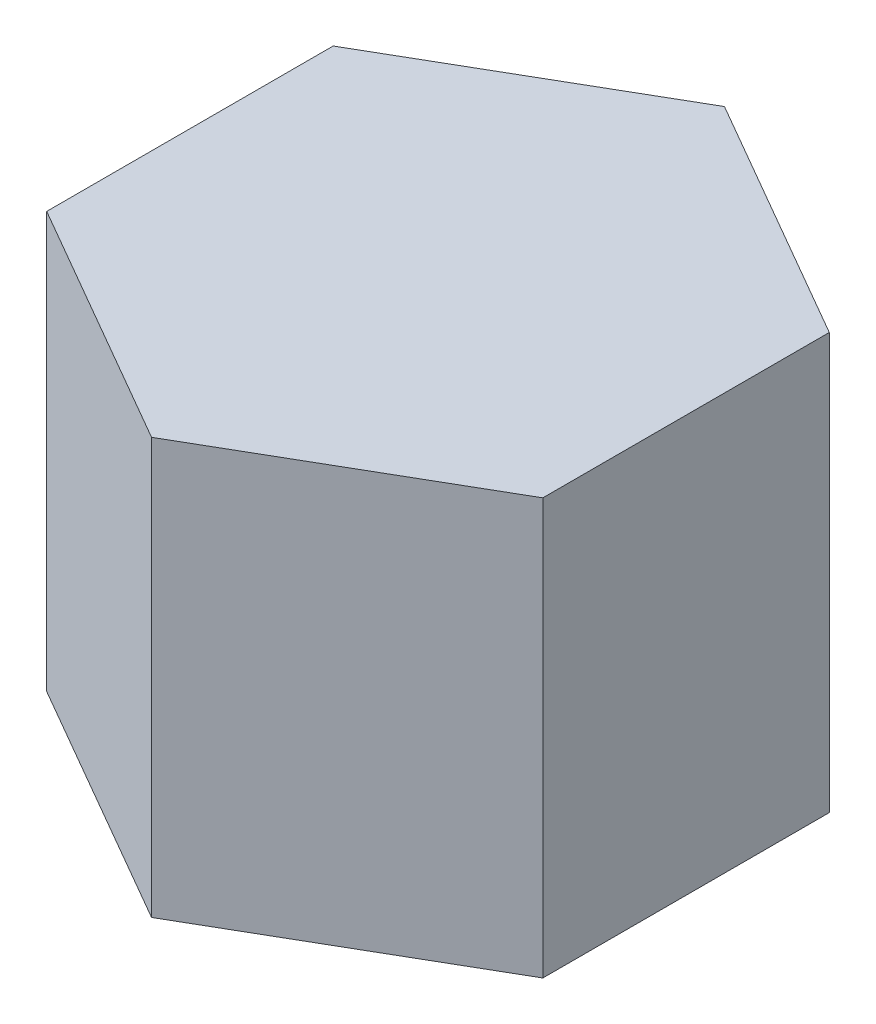
ISO-10303-21;
HEADER;
FILE_DESCRIPTION(('STEP AP214'),'2;1');
FILE_NAME('part.step','',(''),(''),'','','');
FILE_SCHEMA(('AUTOMOTIVE_DESIGN { 1 0 10303 214 1 1 1 1 }'));
ENDSEC;
DATA;
#1=APPLICATION_CONTEXT('core data for automotive mechanical design processes');
#2=APPLICATION_PROTOCOL_DEFINITION('international standard','automotive_design',2000,#1);
#3=PRODUCT_CONTEXT('',#1,'mechanical');
#4=PRODUCT('Part','Part','',(#3));
#5=PRODUCT_RELATED_PRODUCT_CATEGORY('part','',(#4));
#6=PRODUCT_DEFINITION_FORMATION('','',#4);
#7=PRODUCT_DEFINITION_CONTEXT('part definition',#1,'design');
#8=PRODUCT_DEFINITION('design','',#6,#7);
#9=PRODUCT_DEFINITION_SHAPE('','',#8);
#10=(LENGTH_UNIT() NAMED_UNIT(*) SI_UNIT(.MILLI.,.METRE.));
#11=(NAMED_UNIT(*) PLANE_ANGLE_UNIT() SI_UNIT($,.RADIAN.));
#12=(NAMED_UNIT(*) SI_UNIT($,.STERADIAN.) SOLID_ANGLE_UNIT());
#13=UNCERTAINTY_MEASURE_WITH_UNIT(LENGTH_MEASURE(1.E-05),#10,'distance_accuracy_value','');
#14=(GEOMETRIC_REPRESENTATION_CONTEXT(3) GLOBAL_UNCERTAINTY_ASSIGNED_CONTEXT((#13)) GLOBAL_UNIT_ASSIGNED_CONTEXT((#10,
#11,#12)) REPRESENTATION_CONTEXT('',''));
#15=CARTESIAN_POINT('',(0.,0.,0.));
#16=DIRECTION('',(0.,0.,1.));
#17=DIRECTION('',(1.,0.,0.));
#18=AXIS2_PLACEMENT_3D('',#15,#16,#17);
#19=CARTESIAN_POINT('',(211.142660308706,-148.537700895744,295.837098239417));
#20=DIRECTION('',(-0.499999999999909,0.,-0.866025403784491));
#21=DIRECTION('',(-0.866025403784491,0.,0.499999999999909));
#22=AXIS2_PLACEMENT_3D('',#19,#20,#21);
#23=PLANE('',#22);
#24=CARTESIAN_POINT('',(210.839551417381,-149.045793579175,296.012098239417));
#25=DIRECTION('',(0.866025403784491,0.,-0.499999999999909));
#26=VECTOR('',#25,1.);
#27=LINE('',#24,#26);
#28=CARTESIAN_POINT('',(210.839551417382,-149.045793579175,296.012098239417));
#29=VERTEX_POINT('',#28);
#30=CARTESIAN_POINT('',(211.142660308706,-149.045793579175,295.837098239417));
#31=VERTEX_POINT('',#30);
#32=EDGE_CURVE('E170',#29,#31,#27,.T.);
#33=ORIENTED_EDGE('',*,*,#32,.T.);
#34=CARTESIAN_POINT('',(211.142660308706,-148.537700895744,295.837098239417));
#35=DIRECTION('',(0.,-1.,0.));
#36=VECTOR('',#35,1.);
#37=LINE('',#34,#36);
#38=CARTESIAN_POINT('',(211.142660308706,-148.537700895744,295.837098239417));
#39=VERTEX_POINT('',#38);
#40=EDGE_CURVE('E35',#39,#31,#37,.T.);
#41=ORIENTED_EDGE('',*,*,#40,.F.);
#42=CARTESIAN_POINT('',(210.839551417381,-148.537700895744,296.012098239417));
#43=DIRECTION('',(0.866025403784491,0.,-0.499999999999909));
#44=VECTOR('',#43,1.);
#45=LINE('',#42,#44);
#46=CARTESIAN_POINT('',(210.839551417382,-148.537700895744,296.012098239417));
#47=VERTEX_POINT('',#46);
#48=EDGE_CURVE('E159',#47,#39,#45,.T.);
#49=ORIENTED_EDGE('',*,*,#48,.F.);
#50=CARTESIAN_POINT('',(210.839551417381,-148.537700895744,296.012098239417));
#51=DIRECTION('',(0.,-1.,0.));
#52=VECTOR('',#51,1.);
#53=LINE('',#50,#52);
#54=EDGE_CURVE('E10',#47,#29,#53,.T.);
#55=ORIENTED_EDGE('',*,*,#54,.T.);
#56=EDGE_LOOP('',(#33,#41,#49,#55));
#57=FACE_BOUND('',#56,.T.);
#58=ADVANCED_FACE('F16',(#57),#23,.F.);
#59=CARTESIAN_POINT('',(210.839551417382,-148.537700895744,296.012098239417));
#60=DIRECTION('',(0.500000000000096,0.,-0.866025403784383));
#61=DIRECTION('',(-0.866025403784383,0.,-0.500000000000096));
#62=AXIS2_PLACEMENT_3D('',#59,#60,#61);
#63=PLANE('',#62);
#64=CARTESIAN_POINT('',(210.536442526057,-149.045793579175,295.837098239417));
#65=DIRECTION('',(0.866025403784383,0.,0.500000000000096));
#66=VECTOR('',#65,1.);
#67=LINE('',#64,#66);
#68=CARTESIAN_POINT('',(210.536442526057,-149.045793579175,295.837098239417));
#69=VERTEX_POINT('',#68);
#70=EDGE_CURVE('E167',#69,#29,#67,.T.);
#71=ORIENTED_EDGE('',*,*,#70,.T.);
#72=ORIENTED_EDGE('',*,*,#54,.F.);
#73=CARTESIAN_POINT('',(210.536442526057,-148.537700895744,295.837098239417));
#74=DIRECTION('',(0.866025403784383,0.,0.500000000000096));
#75=VECTOR('',#74,1.);
#76=LINE('',#73,#75);
#77=CARTESIAN_POINT('',(210.536442526057,-148.537700895744,295.837098239417));
#78=VERTEX_POINT('',#77);
#79=EDGE_CURVE('E156',#78,#47,#76,.T.);
#80=ORIENTED_EDGE('',*,*,#79,.F.);
#81=CARTESIAN_POINT('',(210.536442526057,-148.537700895744,295.837098239417));
#82=DIRECTION('',(0.,-1.,0.));
#83=VECTOR('',#82,1.);
#84=LINE('',#81,#83);
#85=EDGE_CURVE('E27',#78,#69,#84,.T.);
#86=ORIENTED_EDGE('',*,*,#85,.T.);
#87=EDGE_LOOP('',(#71,#72,#80,#86));
#88=FACE_BOUND('',#87,.T.);
#89=ADVANCED_FACE('F189',(#88),#63,.F.);
#90=CARTESIAN_POINT('',(210.536442526057,-148.537700895744,290.831971220494));
#91=DIRECTION('',(1.,0.,0.));
#92=DIRECTION('',(0.,1.,0.));
#93=AXIS2_PLACEMENT_3D('',#90,#91,#92);
#94=PLANE('',#93);
#95=CARTESIAN_POINT('',(210.536442526057,-149.045793579175,295.487098239417));
#96=DIRECTION('',(0.,0.,1.));
#97=VECTOR('',#96,1.);
#98=LINE('',#95,#97);
#99=CARTESIAN_POINT('',(210.536442526057,-149.045793579175,295.487098239417));
#100=VERTEX_POINT('',#99);
#101=EDGE_CURVE('E163',#100,#69,#98,.T.);
#102=ORIENTED_EDGE('',*,*,#101,.T.);
#103=ORIENTED_EDGE('',*,*,#85,.F.);
#104=CARTESIAN_POINT('',(210.536442526057,-148.537700895744,295.487098239417));
#105=DIRECTION('',(0.,0.,1.));
#106=VECTOR('',#105,1.);
#107=LINE('',#104,#106);
#108=CARTESIAN_POINT('',(210.536442526057,-148.537700895744,295.487098239417));
#109=VERTEX_POINT('',#108);
#110=EDGE_CURVE('E106',#109,#78,#107,.T.);
#111=ORIENTED_EDGE('',*,*,#110,.F.);
#112=CARTESIAN_POINT('',(210.536442526057,-148.537700895744,295.487098239417));
#113=DIRECTION('',(0.,-1.,0.));
#114=VECTOR('',#113,1.);
#115=LINE('',#112,#114);
#116=EDGE_CURVE('E94',#109,#100,#115,.T.);
#117=ORIENTED_EDGE('',*,*,#116,.T.);
#118=EDGE_LOOP('',(#102,#103,#111,#117));
#119=FACE_BOUND('',#118,.T.);
#120=ADVANCED_FACE('F198',(#119),#94,.F.);
#121=CARTESIAN_POINT('',(210.536442526057,-148.537700895744,295.487098239417));
#122=DIRECTION('',(0.499999999999978,0.,0.866025403784452));
#123=DIRECTION('',(0.866025403784452,0.,-0.499999999999978));
#124=AXIS2_PLACEMENT_3D('',#121,#122,#123);
#125=PLANE('',#124);
#126=CARTESIAN_POINT('',(210.839551417382,-149.045793579175,295.312098239417));
#127=DIRECTION('',(-0.866025403784452,0.,0.499999999999978));
#128=VECTOR('',#127,1.);
#129=LINE('',#126,#128);
#130=CARTESIAN_POINT('',(210.839551417382,-149.045793579175,295.312098239417));
#131=VERTEX_POINT('',#130);
#132=EDGE_CURVE('E162',#131,#100,#129,.T.);
#133=ORIENTED_EDGE('',*,*,#132,.T.);
#134=ORIENTED_EDGE('',*,*,#116,.F.);
#135=CARTESIAN_POINT('',(210.839551417382,-148.537700895744,295.312098239417));
#136=DIRECTION('',(-0.866025403784452,0.,0.499999999999978));
#137=VECTOR('',#136,1.);
#138=LINE('',#135,#137);
#139=CARTESIAN_POINT('',(210.839551417382,-148.537700895744,295.312098239417));
#140=VERTEX_POINT('',#139);
#141=EDGE_CURVE('E98',#140,#109,#138,.T.);
#142=ORIENTED_EDGE('',*,*,#141,.F.);
#143=CARTESIAN_POINT('',(210.839551417382,-148.537700895744,295.312098239417));
#144=DIRECTION('',(0.,-1.,0.));
#145=VECTOR('',#144,1.);
#146=LINE('',#143,#145);
#147=EDGE_CURVE('E79',#140,#131,#146,.T.);
#148=ORIENTED_EDGE('',*,*,#147,.T.);
#149=EDGE_LOOP('',(#133,#134,#142,#148));
#150=FACE_BOUND('',#149,.T.);
#151=ADVANCED_FACE('F100',(#150),#125,.F.);
#152=CARTESIAN_POINT('',(210.839551417382,-148.537700895744,295.312098239417));
#153=DIRECTION('',(-0.499999999999943,0.,0.866025403784472));
#154=DIRECTION('',(0.866025403784472,0.,0.499999999999943));
#155=AXIS2_PLACEMENT_3D('',#152,#153,#154);
#156=PLANE('',#155);
#157=CARTESIAN_POINT('',(211.142660308706,-149.045793579175,295.487098239417));
#158=DIRECTION('',(-0.866025403784471,0.,-0.499999999999943));
#159=VECTOR('',#158,1.);
#160=LINE('',#157,#159);
#161=CARTESIAN_POINT('',(211.142660308706,-149.045793579175,295.487098239417));
#162=VERTEX_POINT('',#161);
#163=EDGE_CURVE('E88',#162,#131,#160,.T.);
#164=ORIENTED_EDGE('',*,*,#163,.T.);
#165=ORIENTED_EDGE('',*,*,#147,.F.);
#166=CARTESIAN_POINT('',(211.142660308706,-148.537700895744,295.487098239417));
#167=DIRECTION('',(-0.866025403784471,0.,-0.499999999999943));
#168=VECTOR('',#167,1.);
#169=LINE('',#166,#168);
#170=CARTESIAN_POINT('',(211.142660308706,-148.537700895744,295.487098239417));
#171=VERTEX_POINT('',#170);
#172=EDGE_CURVE('E84',#171,#140,#169,.T.);
#173=ORIENTED_EDGE('',*,*,#172,.F.);
#174=CARTESIAN_POINT('',(211.142660308706,-148.537700895744,295.487098239417));
#175=DIRECTION('',(0.,-1.,0.));
#176=VECTOR('',#175,1.);
#177=LINE('',#174,#176);
#178=EDGE_CURVE('E58',#171,#162,#177,.T.);
#179=ORIENTED_EDGE('',*,*,#178,.T.);
#180=EDGE_LOOP('',(#164,#165,#173,#179));
#181=FACE_BOUND('',#180,.T.);
#182=ADVANCED_FACE('F82',(#181),#156,.F.);
#183=CARTESIAN_POINT('',(211.142660308706,-148.537700895744,290.831971220494));
#184=DIRECTION('',(-1.,0.,0.));
#185=DIRECTION('',(0.,-1.,0.));
#186=AXIS2_PLACEMENT_3D('',#183,#184,#185);
#187=PLANE('',#186);
#188=CARTESIAN_POINT('',(211.142660308706,-149.045793579175,295.837098239417));
#189=DIRECTION('',(0.,0.,-1.));
#190=VECTOR('',#189,1.);
#191=LINE('',#188,#190);
#192=EDGE_CURVE('E160',#31,#162,#191,.T.);
#193=ORIENTED_EDGE('',*,*,#192,.T.);
#194=ORIENTED_EDGE('',*,*,#178,.F.);
#195=CARTESIAN_POINT('',(211.142660308706,-148.537700895744,295.837098239417));
#196=DIRECTION('',(0.,0.,-1.));
#197=VECTOR('',#196,1.);
#198=LINE('',#195,#197);
#199=EDGE_CURVE('E112',#39,#171,#198,.T.);
#200=ORIENTED_EDGE('',*,*,#199,.F.);
#201=ORIENTED_EDGE('',*,*,#40,.T.);
#202=EDGE_LOOP('',(#193,#194,#200,#201));
#203=FACE_BOUND('',#202,.T.);
#204=ADVANCED_FACE('F131',(#203),#187,.F.);
#205=CARTESIAN_POINT('',(206.339551417382,-148.537700895744,290.831971220494));
#206=DIRECTION('',(0.,-1.,0.));
#207=DIRECTION('',(1.,0.,0.));
#208=AXIS2_PLACEMENT_3D('',#205,#206,#207);
#209=PLANE('',#208);
#210=ORIENTED_EDGE('',*,*,#48,.T.);
#211=ORIENTED_EDGE('',*,*,#199,.T.);
#212=ORIENTED_EDGE('',*,*,#172,.T.);
#213=ORIENTED_EDGE('',*,*,#141,.T.);
#214=ORIENTED_EDGE('',*,*,#110,.T.);
#215=ORIENTED_EDGE('',*,*,#79,.T.);
#216=EDGE_LOOP('',(#210,#211,#212,#213,#214,#215));
#217=FACE_BOUND('',#216,.T.);
#218=ADVANCED_FACE('F111',(#217),#209,.F.);
#219=CARTESIAN_POINT('',(206.339551417382,-149.045793579175,290.831971220494));
#220=DIRECTION('',(0.,-1.,0.));
#221=DIRECTION('',(1.,0.,0.));
#222=AXIS2_PLACEMENT_3D('',#219,#220,#221);
#223=PLANE('',#222);
#224=ORIENTED_EDGE('',*,*,#32,.F.);
#225=ORIENTED_EDGE('',*,*,#70,.F.);
#226=ORIENTED_EDGE('',*,*,#101,.F.);
#227=ORIENTED_EDGE('',*,*,#132,.F.);
#228=ORIENTED_EDGE('',*,*,#163,.F.);
#229=ORIENTED_EDGE('',*,*,#192,.F.);
#230=EDGE_LOOP('',(#224,#225,#226,#227,#228,#229));
#231=FACE_BOUND('',#230,.T.);
#232=ADVANCED_FACE('F130',(#231),#223,.T.);
#233=CLOSED_SHELL('',(#58,#89,#120,#151,#182,#204,#218,#232));
#234=MANIFOLD_SOLID_BREP('B1',#233);
#235=ADVANCED_BREP_SHAPE_REPRESENTATION('',(#18,#234),#14);
#236=SHAPE_DEFINITION_REPRESENTATION(#9,#235);
ENDSEC;
END-ISO-10303-21;
